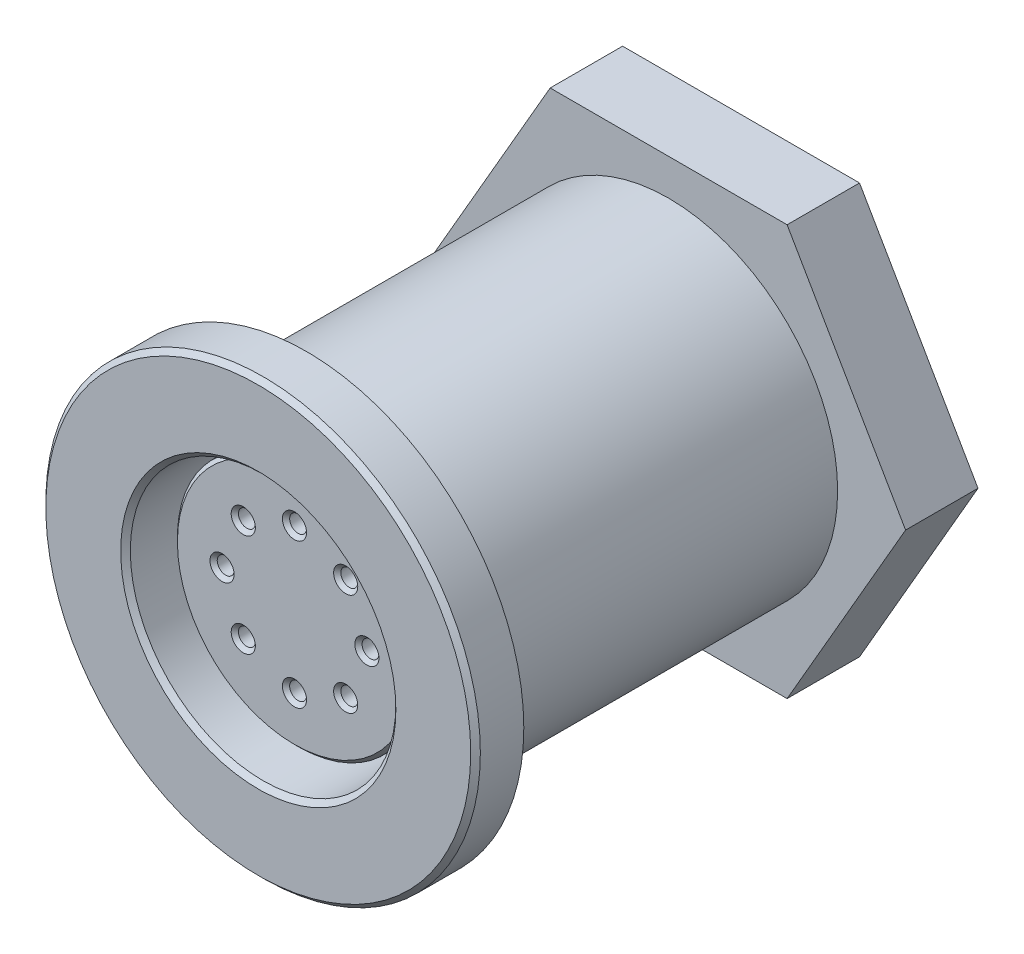
ISO-10303-21;
HEADER;
FILE_DESCRIPTION(('STEP AP214'),'2;1');
FILE_NAME('part.step','',(''),(''),'','','');
FILE_SCHEMA(('AUTOMOTIVE_DESIGN { 1 0 10303 214 1 1 1 1 }'));
ENDSEC;
DATA;
#1=APPLICATION_CONTEXT('core data for automotive mechanical design processes');
#2=APPLICATION_PROTOCOL_DEFINITION('international standard','automotive_design',2000,#1);
#3=PRODUCT_CONTEXT('',#1,'mechanical');
#4=PRODUCT('Part','Part','',(#3));
#5=PRODUCT_RELATED_PRODUCT_CATEGORY('part','',(#4));
#6=PRODUCT_DEFINITION_FORMATION('','',#4);
#7=PRODUCT_DEFINITION_CONTEXT('part definition',#1,'design');
#8=PRODUCT_DEFINITION('design','',#6,#7);
#9=PRODUCT_DEFINITION_SHAPE('','',#8);
#10=(LENGTH_UNIT() NAMED_UNIT(*) SI_UNIT(.MILLI.,.METRE.));
#11=(NAMED_UNIT(*) PLANE_ANGLE_UNIT() SI_UNIT($,.RADIAN.));
#12=(NAMED_UNIT(*) SI_UNIT($,.STERADIAN.) SOLID_ANGLE_UNIT());
#13=UNCERTAINTY_MEASURE_WITH_UNIT(LENGTH_MEASURE(1.E-05),#10,'distance_accuracy_value','');
#14=(GEOMETRIC_REPRESENTATION_CONTEXT(3) GLOBAL_UNCERTAINTY_ASSIGNED_CONTEXT((#13)) GLOBAL_UNIT_ASSIGNED_CONTEXT((#10,
#11,#12)) REPRESENTATION_CONTEXT('',''));
#15=CARTESIAN_POINT('',(0.,0.,0.));
#16=DIRECTION('',(0.,0.,1.));
#17=DIRECTION('',(1.,0.,0.));
#18=AXIS2_PLACEMENT_3D('',#15,#16,#17);
#19=CARTESIAN_POINT('',(0.,0.,-19.));
#20=DIRECTION('',(0.,0.,1.));
#21=DIRECTION('',(1.,0.,0.));
#22=AXIS2_PLACEMENT_3D('',#19,#20,#21);
#23=CYLINDRICAL_SURFACE('',#22,7.);
#24=CARTESIAN_POINT('',(0.,0.,1.));
#25=DIRECTION('',(0.,0.,-1.));
#26=DIRECTION('',(-1.,0.,0.));
#27=AXIS2_PLACEMENT_3D('',#24,#25,#26);
#28=CIRCLE('',#27,7.);
#29=CARTESIAN_POINT('',(-7.,0.,1.));
#30=VERTEX_POINT('',#29);
#31=EDGE_CURVE('E173',#30,#30,#28,.T.);
#32=ORIENTED_EDGE('',*,*,#31,.T.);
#33=EDGE_LOOP('',(#32));
#34=FACE_BOUND('',#33,.T.);
#35=CARTESIAN_POINT('',(0.,0.,-15.));
#36=DIRECTION('',(0.,0.,-1.));
#37=DIRECTION('',(-1.,0.,0.));
#38=AXIS2_PLACEMENT_3D('',#35,#36,#37);
#39=CIRCLE('',#38,7.);
#40=CARTESIAN_POINT('',(-7.,0.,-15.));
#41=VERTEX_POINT('',#40);
#42=EDGE_CURVE('E11',#41,#41,#39,.T.);
#43=ORIENTED_EDGE('',*,*,#42,.F.);
#44=EDGE_LOOP('',(#43));
#45=FACE_BOUND('',#44,.T.);
#46=ADVANCED_FACE('F32',(#34,#45),#23,.T.);
#47=CARTESIAN_POINT('',(0.,0.,-8.));
#48=DIRECTION('',(0.,0.,1.));
#49=DIRECTION('',(1.,0.,0.));
#50=AXIS2_PLACEMENT_3D('',#47,#48,#49);
#51=PLANE('',#50);
#52=CARTESIAN_POINT('',(0.,0.,-8.));
#53=DIRECTION('',(0.,0.,1.));
#54=DIRECTION('',(1.,0.,0.));
#55=AXIS2_PLACEMENT_3D('',#52,#53,#54);
#56=CIRCLE('',#55,5.5);
#57=CARTESIAN_POINT('',(5.5,0.,-8.));
#58=VERTEX_POINT('',#57);
#59=EDGE_CURVE('E182',#58,#58,#56,.T.);
#60=ORIENTED_EDGE('',*,*,#59,.T.);
#61=EDGE_LOOP('',(#60));
#62=FACE_BOUND('',#61,.T.);
#63=CARTESIAN_POINT('',(0.,0.,-8.));
#64=DIRECTION('',(0.,0.,1.));
#65=DIRECTION('',(1.,0.,0.));
#66=AXIS2_PLACEMENT_3D('',#63,#64,#65);
#67=CIRCLE('',#66,5.);
#68=CARTESIAN_POINT('',(5.,0.,-8.));
#69=VERTEX_POINT('',#68);
#70=EDGE_CURVE('E170',#69,#69,#67,.T.);
#71=ORIENTED_EDGE('',*,*,#70,.F.);
#72=EDGE_LOOP('',(#71));
#73=FACE_BOUND('',#72,.T.);
#74=ADVANCED_FACE('F286',(#62,#73),#51,.T.);
#75=CARTESIAN_POINT('',(0.,0.,0.));
#76=DIRECTION('',(0.,0.,1.));
#77=DIRECTION('',(1.,0.,0.));
#78=AXIS2_PLACEMENT_3D('',#75,#76,#77);
#79=PLANE('',#78);
#80=CARTESIAN_POINT('',(0.,0.,0.));
#81=DIRECTION('',(0.,0.,-1.));
#82=DIRECTION('',(-1.,0.,0.));
#83=AXIS2_PLACEMENT_3D('',#80,#81,#82);
#84=CIRCLE('',#83,7.8);
#85=CARTESIAN_POINT('',(-7.8,0.,0.));
#86=VERTEX_POINT('',#85);
#87=EDGE_CURVE('E176',#86,#86,#84,.T.);
#88=ORIENTED_EDGE('',*,*,#87,.F.);
#89=EDGE_LOOP('',(#88));
#90=FACE_BOUND('',#89,.T.);
#91=CARTESIAN_POINT('',(0.,0.,0.));
#92=DIRECTION('',(0.,0.,1.));
#93=DIRECTION('',(1.,0.,0.));
#94=AXIS2_PLACEMENT_3D('',#91,#92,#93);
#95=CIRCLE('',#94,9.);
#96=CARTESIAN_POINT('',(9.,0.,0.));
#97=VERTEX_POINT('',#96);
#98=EDGE_CURVE('E185',#97,#97,#95,.T.);
#99=ORIENTED_EDGE('',*,*,#98,.F.);
#100=EDGE_LOOP('',(#99));
#101=FACE_BOUND('',#100,.T.);
#102=ADVANCED_FACE('F292',(#90,#101),#79,.F.);
#103=CARTESIAN_POINT('',(0.,0.,2.));
#104=DIRECTION('',(0.,0.,-1.));
#105=DIRECTION('',(-1.,0.,0.));
#106=AXIS2_PLACEMENT_3D('',#103,#104,#105);
#107=CYLINDRICAL_SURFACE('',#106,9.);
#108=CARTESIAN_POINT('',(0.,0.,1.80000000000001));
#109=DIRECTION('',(0.,0.,1.));
#110=DIRECTION('',(1.,0.,0.));
#111=AXIS2_PLACEMENT_3D('',#108,#109,#110);
#112=CIRCLE('',#111,9.);
#113=CARTESIAN_POINT('',(9.,0.,1.80000000000001));
#114=VERTEX_POINT('',#113);
#115=EDGE_CURVE('E251',#114,#114,#112,.F.);
#116=ORIENTED_EDGE('',*,*,#115,.T.);
#117=EDGE_LOOP('',(#116));
#118=FACE_BOUND('',#117,.T.);
#119=ORIENTED_EDGE('',*,*,#98,.T.);
#120=EDGE_LOOP('',(#119));
#121=FACE_BOUND('',#120,.T.);
#122=ADVANCED_FACE('F34',(#118,#121),#107,.T.);
#123=CARTESIAN_POINT('',(0.,0.,2.));
#124=DIRECTION('',(0.,0.,1.));
#125=DIRECTION('',(1.,0.,0.));
#126=AXIS2_PLACEMENT_3D('',#123,#124,#125);
#127=PLANE('',#126);
#128=CARTESIAN_POINT('',(0.,0.,2.));
#129=DIRECTION('',(0.,0.,1.));
#130=DIRECTION('',(1.,0.,0.));
#131=AXIS2_PLACEMENT_3D('',#128,#129,#130);
#132=CIRCLE('',#131,5.7);
#133=CARTESIAN_POINT('',(5.7,0.,2.));
#134=VERTEX_POINT('',#133);
#135=EDGE_CURVE('E248',#134,#134,#132,.F.);
#136=ORIENTED_EDGE('',*,*,#135,.T.);
#137=EDGE_LOOP('',(#136));
#138=FACE_BOUND('',#137,.T.);
#139=CARTESIAN_POINT('',(0.,0.,2.));
#140=DIRECTION('',(0.,0.,1.));
#141=DIRECTION('',(1.,0.,0.));
#142=AXIS2_PLACEMENT_3D('',#139,#140,#141);
#143=CIRCLE('',#142,8.80000000000001);
#144=CARTESIAN_POINT('',(8.80000000000001,0.,2.));
#145=VERTEX_POINT('',#144);
#146=EDGE_CURVE('E245',#145,#145,#143,.T.);
#147=ORIENTED_EDGE('',*,*,#146,.T.);
#148=EDGE_LOOP('',(#147));
#149=FACE_BOUND('',#148,.T.);
#150=ADVANCED_FACE('F657',(#138,#149),#127,.T.);
#151=CARTESIAN_POINT('',(0.,0.,-8.));
#152=DIRECTION('',(0.,0.,1.));
#153=DIRECTION('',(1.,0.,0.));
#154=AXIS2_PLACEMENT_3D('',#151,#152,#153);
#155=CYLINDRICAL_SURFACE('',#154,5.5);
#156=CARTESIAN_POINT('',(0.,0.,1.8));
#157=DIRECTION('',(0.,0.,1.));
#158=DIRECTION('',(1.,0.,0.));
#159=AXIS2_PLACEMENT_3D('',#156,#157,#158);
#160=CIRCLE('',#159,5.5);
#161=CARTESIAN_POINT('',(5.5,0.,1.8));
#162=VERTEX_POINT('',#161);
#163=EDGE_CURVE('E242',#162,#162,#160,.T.);
#164=ORIENTED_EDGE('',*,*,#163,.T.);
#165=EDGE_LOOP('',(#164));
#166=FACE_BOUND('',#165,.T.);
#167=ORIENTED_EDGE('',*,*,#59,.F.);
#168=EDGE_LOOP('',(#167));
#169=FACE_BOUND('',#168,.T.);
#170=ADVANCED_FACE('F649',(#166,#169),#155,.F.);
#171=CARTESIAN_POINT('',(0.,0.,1.));
#172=DIRECTION('',(0.,0.,-1.));
#173=DIRECTION('',(-1.,0.,0.));
#174=AXIS2_PLACEMENT_3D('',#171,#172,#173);
#175=CYLINDRICAL_SURFACE('',#174,7.8);
#176=CARTESIAN_POINT('',(0.,0.,1.));
#177=DIRECTION('',(0.,0.,-1.));
#178=DIRECTION('',(-1.,0.,0.));
#179=AXIS2_PLACEMENT_3D('',#176,#177,#178);
#180=CIRCLE('',#179,7.8);
#181=CARTESIAN_POINT('',(-7.8,0.,1.));
#182=VERTEX_POINT('',#181);
#183=EDGE_CURVE('E179',#182,#182,#180,.T.);
#184=ORIENTED_EDGE('',*,*,#183,.F.);
#185=EDGE_LOOP('',(#184));
#186=FACE_BOUND('',#185,.T.);
#187=ORIENTED_EDGE('',*,*,#87,.T.);
#188=EDGE_LOOP('',(#187));
#189=FACE_BOUND('',#188,.T.);
#190=ADVANCED_FACE('F641',(#186,#189),#175,.F.);
#191=CARTESIAN_POINT('',(0.,0.,1.));
#192=DIRECTION('',(0.,0.,-1.));
#193=DIRECTION('',(-1.,0.,0.));
#194=AXIS2_PLACEMENT_3D('',#191,#192,#193);
#195=PLANE('',#194);
#196=ORIENTED_EDGE('',*,*,#31,.F.);
#197=EDGE_LOOP('',(#196));
#198=FACE_BOUND('',#197,.T.);
#199=ORIENTED_EDGE('',*,*,#183,.T.);
#200=EDGE_LOOP('',(#199));
#201=FACE_BOUND('',#200,.T.);
#202=ADVANCED_FACE('F633',(#198,#201),#195,.T.);
#203=CARTESIAN_POINT('',(0.,0.,0.5));
#204=DIRECTION('',(0.,0.,-1.));
#205=DIRECTION('',(-1.,0.,0.));
#206=AXIS2_PLACEMENT_3D('',#203,#204,#205);
#207=CYLINDRICAL_SURFACE('',#206,5.);
#208=CARTESIAN_POINT('',(0.,0.,0.350000000000002));
#209=DIRECTION('',(0.,0.,1.));
#210=DIRECTION('',(1.,0.,0.));
#211=AXIS2_PLACEMENT_3D('',#208,#209,#210);
#212=CIRCLE('',#211,5.);
#213=CARTESIAN_POINT('',(5.,0.,0.350000000000002));
#214=VERTEX_POINT('',#213);
#215=EDGE_CURVE('E233',#214,#214,#212,.F.);
#216=ORIENTED_EDGE('',*,*,#215,.T.);
#217=EDGE_LOOP('',(#216));
#218=FACE_BOUND('',#217,.T.);
#219=ORIENTED_EDGE('',*,*,#70,.T.);
#220=EDGE_LOOP('',(#219));
#221=FACE_BOUND('',#220,.T.);
#222=ADVANCED_FACE('F626',(#218,#221),#207,.T.);
#223=CARTESIAN_POINT('',(0.,0.,0.5));
#224=DIRECTION('',(0.,0.,1.));
#225=DIRECTION('',(1.,0.,0.));
#226=AXIS2_PLACEMENT_3D('',#223,#224,#225);
#227=PLANE('',#226);
#228=CARTESIAN_POINT('',(3.,0.,0.5));
#229=DIRECTION('',(0.,0.,1.));
#230=DIRECTION('',(1.,0.,0.));
#231=AXIS2_PLACEMENT_3D('',#228,#229,#230);
#232=CIRCLE('',#231,0.5);
#233=CARTESIAN_POINT('',(3.5,0.,0.5));
#234=VERTEX_POINT('',#233);
#235=EDGE_CURVE('E215',#234,#234,#232,.F.);
#236=ORIENTED_EDGE('',*,*,#235,.T.);
#237=EDGE_LOOP('',(#236));
#238=FACE_BOUND('',#237,.T.);
#239=CARTESIAN_POINT('',(-3.,0.,0.5));
#240=DIRECTION('',(0.,0.,1.));
#241=DIRECTION('',(1.,0.,0.));
#242=AXIS2_PLACEMENT_3D('',#239,#240,#241);
#243=CIRCLE('',#242,0.500000000000011);
#244=CARTESIAN_POINT('',(-2.49999999999999,0.,0.5));
#245=VERTEX_POINT('',#244);
#246=EDGE_CURVE('E212',#245,#245,#243,.F.);
#247=ORIENTED_EDGE('',*,*,#246,.T.);
#248=EDGE_LOOP('',(#247));
#249=FACE_BOUND('',#248,.T.);
#250=CARTESIAN_POINT('',(2.12132034355965,-2.12132034355963,0.5));
#251=DIRECTION('',(0.,0.,1.));
#252=DIRECTION('',(1.,0.,0.));
#253=AXIS2_PLACEMENT_3D('',#250,#251,#252);
#254=CIRCLE('',#253,0.500000000000011);
#255=CARTESIAN_POINT('',(2.62132034355967,-2.12132034355963,0.5));
#256=VERTEX_POINT('',#255);
#257=EDGE_CURVE('E209',#256,#256,#254,.F.);
#258=ORIENTED_EDGE('',*,*,#257,.T.);
#259=EDGE_LOOP('',(#258));
#260=FACE_BOUND('',#259,.T.);
#261=CARTESIAN_POINT('',(2.12132034355965,2.12132034355963,0.5));
#262=DIRECTION('',(0.,0.,1.));
#263=DIRECTION('',(1.,0.,0.));
#264=AXIS2_PLACEMENT_3D('',#261,#262,#263);
#265=CIRCLE('',#264,0.500000000000011);
#266=CARTESIAN_POINT('',(2.62132034355967,2.12132034355963,0.5));
#267=VERTEX_POINT('',#266);
#268=EDGE_CURVE('E206',#267,#267,#265,.F.);
#269=ORIENTED_EDGE('',*,*,#268,.T.);
#270=EDGE_LOOP('',(#269));
#271=FACE_BOUND('',#270,.T.);
#272=CARTESIAN_POINT('',(-2.12132034355965,-2.12132034355963,0.5));
#273=DIRECTION('',(0.,0.,1.));
#274=DIRECTION('',(1.,0.,0.));
#275=AXIS2_PLACEMENT_3D('',#272,#273,#274);
#276=CIRCLE('',#275,0.500000000000011);
#277=CARTESIAN_POINT('',(-1.62132034355964,-2.12132034355963,0.5));
#278=VERTEX_POINT('',#277);
#279=EDGE_CURVE('E203',#278,#278,#276,.F.);
#280=ORIENTED_EDGE('',*,*,#279,.T.);
#281=EDGE_LOOP('',(#280));
#282=FACE_BOUND('',#281,.T.);
#283=CARTESIAN_POINT('',(-2.12132034355965,2.12132034355963,0.5));
#284=DIRECTION('',(0.,0.,1.));
#285=DIRECTION('',(1.,0.,0.));
#286=AXIS2_PLACEMENT_3D('',#283,#284,#285);
#287=CIRCLE('',#286,0.500000000000011);
#288=CARTESIAN_POINT('',(-1.62132034355964,2.12132034355963,0.5));
#289=VERTEX_POINT('',#288);
#290=EDGE_CURVE('E200',#289,#289,#287,.F.);
#291=ORIENTED_EDGE('',*,*,#290,.T.);
#292=EDGE_LOOP('',(#291));
#293=FACE_BOUND('',#292,.T.);
#294=CARTESIAN_POINT('',(0.,0.,0.5));
#295=DIRECTION('',(0.,0.,1.));
#296=DIRECTION('',(1.,0.,0.));
#297=AXIS2_PLACEMENT_3D('',#294,#295,#296);
#298=CIRCLE('',#297,4.85);
#299=CARTESIAN_POINT('',(4.85,0.,0.5));
#300=VERTEX_POINT('',#299);
#301=EDGE_CURVE('E197',#300,#300,#298,.T.);
#302=ORIENTED_EDGE('',*,*,#301,.T.);
#303=EDGE_LOOP('',(#302));
#304=FACE_BOUND('',#303,.T.);
#305=CARTESIAN_POINT('',(0.,-3.,0.5));
#306=DIRECTION('',(0.,0.,1.));
#307=DIRECTION('',(1.,0.,0.));
#308=AXIS2_PLACEMENT_3D('',#305,#306,#307);
#309=CIRCLE('',#308,0.500000000000011);
#310=CARTESIAN_POINT('',(0.500000000000011,-3.,0.5));
#311=VERTEX_POINT('',#310);
#312=EDGE_CURVE('E194',#311,#311,#309,.F.);
#313=ORIENTED_EDGE('',*,*,#312,.T.);
#314=EDGE_LOOP('',(#313));
#315=FACE_BOUND('',#314,.T.);
#316=CARTESIAN_POINT('',(0.,3.,0.5));
#317=DIRECTION('',(0.,0.,1.));
#318=DIRECTION('',(1.,0.,0.));
#319=AXIS2_PLACEMENT_3D('',#316,#317,#318);
#320=CIRCLE('',#319,0.500000000000011);
#321=CARTESIAN_POINT('',(0.500000000000011,3.,0.5));
#322=VERTEX_POINT('',#321);
#323=EDGE_CURVE('E191',#322,#322,#320,.F.);
#324=ORIENTED_EDGE('',*,*,#323,.T.);
#325=EDGE_LOOP('',(#324));
#326=FACE_BOUND('',#325,.T.);
#327=ADVANCED_FACE('F618',(#238,#249,#260,#271,#282,#293,#304,#315,#326),#227,.T.);
#328=CARTESIAN_POINT('',(0.,3.,-6.5));
#329=DIRECTION('',(0.,0.,1.));
#330=DIRECTION('',(1.,0.,0.));
#331=AXIS2_PLACEMENT_3D('',#328,#329,#330);
#332=CYLINDRICAL_SURFACE('',#331,0.35);
#333=CARTESIAN_POINT('',(0.,3.,0.349999999999992));
#334=DIRECTION('',(0.,0.,1.));
#335=DIRECTION('',(1.,0.,0.));
#336=AXIS2_PLACEMENT_3D('',#333,#334,#335);
#337=CIRCLE('',#336,0.35);
#338=CARTESIAN_POINT('',(0.35,3.,0.349999999999992));
#339=VERTEX_POINT('',#338);
#340=EDGE_CURVE('E239',#339,#339,#337,.T.);
#341=ORIENTED_EDGE('',*,*,#340,.T.);
#342=EDGE_LOOP('',(#341));
#343=FACE_BOUND('',#342,.T.);
#344=CARTESIAN_POINT('',(0.,3.,-6.5));
#345=DIRECTION('',(0.,0.,1.));
#346=DIRECTION('',(1.,0.,0.));
#347=AXIS2_PLACEMENT_3D('',#344,#345,#346);
#348=CIRCLE('',#347,0.35);
#349=CARTESIAN_POINT('',(0.35,3.,-6.5));
#350=VERTEX_POINT('',#349);
#351=EDGE_CURVE('E167',#350,#350,#348,.T.);
#352=ORIENTED_EDGE('',*,*,#351,.F.);
#353=EDGE_LOOP('',(#352));
#354=FACE_BOUND('',#353,.T.);
#355=ADVANCED_FACE('F610',(#343,#354),#332,.F.);
#356=CARTESIAN_POINT('',(0.,3.,-6.5));
#357=DIRECTION('',(0.,0.,1.));
#358=DIRECTION('',(1.,0.,0.));
#359=AXIS2_PLACEMENT_3D('',#356,#357,#358);
#360=PLANE('',#359);
#361=ORIENTED_EDGE('',*,*,#351,.T.);
#362=EDGE_LOOP('',(#361));
#363=FACE_BOUND('',#362,.T.);
#364=ADVANCED_FACE('F602',(#363),#360,.T.);
#365=CARTESIAN_POINT('',(0.,-3.,-6.5));
#366=DIRECTION('',(0.,0.,1.));
#367=DIRECTION('',(1.,0.,0.));
#368=AXIS2_PLACEMENT_3D('',#365,#366,#367);
#369=CYLINDRICAL_SURFACE('',#368,0.35);
#370=CARTESIAN_POINT('',(0.,-3.,0.349999999999992));
#371=DIRECTION('',(0.,0.,1.));
#372=DIRECTION('',(1.,0.,0.));
#373=AXIS2_PLACEMENT_3D('',#370,#371,#372);
#374=CIRCLE('',#373,0.35);
#375=CARTESIAN_POINT('',(0.35,-3.,0.349999999999992));
#376=VERTEX_POINT('',#375);
#377=EDGE_CURVE('E236',#376,#376,#374,.T.);
#378=ORIENTED_EDGE('',*,*,#377,.T.);
#379=EDGE_LOOP('',(#378));
#380=FACE_BOUND('',#379,.T.);
#381=CARTESIAN_POINT('',(0.,-3.,-6.5));
#382=DIRECTION('',(0.,0.,1.));
#383=DIRECTION('',(1.,0.,0.));
#384=AXIS2_PLACEMENT_3D('',#381,#382,#383);
#385=CIRCLE('',#384,0.35);
#386=CARTESIAN_POINT('',(0.35,-3.,-6.5));
#387=VERTEX_POINT('',#386);
#388=EDGE_CURVE('E164',#387,#387,#385,.T.);
#389=ORIENTED_EDGE('',*,*,#388,.F.);
#390=EDGE_LOOP('',(#389));
#391=FACE_BOUND('',#390,.T.);
#392=ADVANCED_FACE('F594',(#380,#391),#369,.F.);
#393=CARTESIAN_POINT('',(0.,-3.,-6.5));
#394=DIRECTION('',(0.,0.,1.));
#395=DIRECTION('',(1.,0.,0.));
#396=AXIS2_PLACEMENT_3D('',#393,#394,#395);
#397=PLANE('',#396);
#398=ORIENTED_EDGE('',*,*,#388,.T.);
#399=EDGE_LOOP('',(#398));
#400=FACE_BOUND('',#399,.T.);
#401=ADVANCED_FACE('F586',(#400),#397,.T.);
#402=CARTESIAN_POINT('',(2.12132034355965,2.12132034355963,-6.5));
#403=DIRECTION('',(0.,0.,1.));
#404=DIRECTION('',(1.,0.,0.));
#405=AXIS2_PLACEMENT_3D('',#402,#403,#404);
#406=CYLINDRICAL_SURFACE('',#405,0.35);
#407=CARTESIAN_POINT('',(2.12132034355965,2.12132034355963,0.349999999999992));
#408=DIRECTION('',(0.,0.,1.));
#409=DIRECTION('',(1.,0.,0.));
#410=AXIS2_PLACEMENT_3D('',#407,#408,#409);
#411=CIRCLE('',#410,0.35);
#412=CARTESIAN_POINT('',(2.47132034355965,2.12132034355963,0.349999999999992));
#413=VERTEX_POINT('',#412);
#414=EDGE_CURVE('E224',#413,#413,#411,.T.);
#415=ORIENTED_EDGE('',*,*,#414,.T.);
#416=EDGE_LOOP('',(#415));
#417=FACE_BOUND('',#416,.T.);
#418=CARTESIAN_POINT('',(2.12132034355965,2.12132034355963,-6.5));
#419=DIRECTION('',(0.,0.,1.));
#420=DIRECTION('',(1.,0.,0.));
#421=AXIS2_PLACEMENT_3D('',#418,#419,#420);
#422=CIRCLE('',#421,0.35);
#423=CARTESIAN_POINT('',(2.47132034355965,2.12132034355963,-6.5));
#424=VERTEX_POINT('',#423);
#425=EDGE_CURVE('E161',#424,#424,#422,.T.);
#426=ORIENTED_EDGE('',*,*,#425,.F.);
#427=EDGE_LOOP('',(#426));
#428=FACE_BOUND('',#427,.T.);
#429=ADVANCED_FACE('F578',(#417,#428),#406,.F.);
#430=CARTESIAN_POINT('',(2.12132034355965,2.12132034355963,-6.5));
#431=DIRECTION('',(0.,0.,1.));
#432=DIRECTION('',(1.,0.,0.));
#433=AXIS2_PLACEMENT_3D('',#430,#431,#432);
#434=PLANE('',#433);
#435=ORIENTED_EDGE('',*,*,#425,.T.);
#436=EDGE_LOOP('',(#435));
#437=FACE_BOUND('',#436,.T.);
#438=ADVANCED_FACE('F570',(#437),#434,.T.);
#439=CARTESIAN_POINT('',(2.12132034355965,-2.12132034355963,-6.5));
#440=DIRECTION('',(0.,0.,1.));
#441=DIRECTION('',(1.,0.,0.));
#442=AXIS2_PLACEMENT_3D('',#439,#440,#441);
#443=CYLINDRICAL_SURFACE('',#442,0.350000000000001);
#444=CARTESIAN_POINT('',(2.12132034355965,-2.12132034355963,0.349999999999993));
#445=DIRECTION('',(0.,0.,1.));
#446=DIRECTION('',(1.,0.,0.));
#447=AXIS2_PLACEMENT_3D('',#444,#445,#446);
#448=CIRCLE('',#447,0.350000000000001);
#449=CARTESIAN_POINT('',(2.47132034355966,-2.12132034355963,0.349999999999993));
#450=VERTEX_POINT('',#449);
#451=EDGE_CURVE('E221',#450,#450,#448,.T.);
#452=ORIENTED_EDGE('',*,*,#451,.T.);
#453=EDGE_LOOP('',(#452));
#454=FACE_BOUND('',#453,.T.);
#455=CARTESIAN_POINT('',(2.12132034355965,-2.12132034355963,-6.5));
#456=DIRECTION('',(0.,0.,1.));
#457=DIRECTION('',(1.,0.,0.));
#458=AXIS2_PLACEMENT_3D('',#455,#456,#457);
#459=CIRCLE('',#458,0.350000000000001);
#460=CARTESIAN_POINT('',(2.47132034355966,-2.12132034355963,-6.5));
#461=VERTEX_POINT('',#460);
#462=EDGE_CURVE('E158',#461,#461,#459,.T.);
#463=ORIENTED_EDGE('',*,*,#462,.F.);
#464=EDGE_LOOP('',(#463));
#465=FACE_BOUND('',#464,.T.);
#466=ADVANCED_FACE('F562',(#454,#465),#443,.F.);
#467=CARTESIAN_POINT('',(2.12132034355965,-2.12132034355963,-6.5));
#468=DIRECTION('',(0.,0.,1.));
#469=DIRECTION('',(1.,0.,0.));
#470=AXIS2_PLACEMENT_3D('',#467,#468,#469);
#471=PLANE('',#470);
#472=ORIENTED_EDGE('',*,*,#462,.T.);
#473=EDGE_LOOP('',(#472));
#474=FACE_BOUND('',#473,.T.);
#475=ADVANCED_FACE('F554',(#474),#471,.T.);
#476=CARTESIAN_POINT('',(-2.12132034355965,2.12132034355963,-6.5));
#477=DIRECTION('',(0.,0.,1.));
#478=DIRECTION('',(1.,0.,0.));
#479=AXIS2_PLACEMENT_3D('',#476,#477,#478);
#480=CYLINDRICAL_SURFACE('',#479,0.35);
#481=CARTESIAN_POINT('',(-2.12132034355965,2.12132034355963,0.349999999999992));
#482=DIRECTION('',(0.,0.,1.));
#483=DIRECTION('',(1.,0.,0.));
#484=AXIS2_PLACEMENT_3D('',#481,#482,#483);
#485=CIRCLE('',#484,0.35);
#486=CARTESIAN_POINT('',(-1.77132034355965,2.12132034355963,0.349999999999992));
#487=VERTEX_POINT('',#486);
#488=EDGE_CURVE('E230',#487,#487,#485,.T.);
#489=ORIENTED_EDGE('',*,*,#488,.T.);
#490=EDGE_LOOP('',(#489));
#491=FACE_BOUND('',#490,.T.);
#492=CARTESIAN_POINT('',(-2.12132034355965,2.12132034355963,-6.5));
#493=DIRECTION('',(0.,0.,1.));
#494=DIRECTION('',(1.,0.,0.));
#495=AXIS2_PLACEMENT_3D('',#492,#493,#494);
#496=CIRCLE('',#495,0.35);
#497=CARTESIAN_POINT('',(-1.77132034355965,2.12132034355963,-6.5));
#498=VERTEX_POINT('',#497);
#499=EDGE_CURVE('E155',#498,#498,#496,.T.);
#500=ORIENTED_EDGE('',*,*,#499,.F.);
#501=EDGE_LOOP('',(#500));
#502=FACE_BOUND('',#501,.T.);
#503=ADVANCED_FACE('F546',(#491,#502),#480,.F.);
#504=CARTESIAN_POINT('',(-2.12132034355965,2.12132034355963,-6.5));
#505=DIRECTION('',(0.,0.,1.));
#506=DIRECTION('',(1.,0.,0.));
#507=AXIS2_PLACEMENT_3D('',#504,#505,#506);
#508=PLANE('',#507);
#509=ORIENTED_EDGE('',*,*,#499,.T.);
#510=EDGE_LOOP('',(#509));
#511=FACE_BOUND('',#510,.T.);
#512=ADVANCED_FACE('F538',(#511),#508,.T.);
#513=CARTESIAN_POINT('',(-2.12132034355965,-2.12132034355963,-6.5));
#514=DIRECTION('',(0.,0.,1.));
#515=DIRECTION('',(1.,0.,0.));
#516=AXIS2_PLACEMENT_3D('',#513,#514,#515);
#517=CYLINDRICAL_SURFACE('',#516,0.35);
#518=CARTESIAN_POINT('',(-2.12132034355965,-2.12132034355963,0.349999999999992));
#519=DIRECTION('',(0.,0.,1.));
#520=DIRECTION('',(1.,0.,0.));
#521=AXIS2_PLACEMENT_3D('',#518,#519,#520);
#522=CIRCLE('',#521,0.35);
#523=CARTESIAN_POINT('',(-1.77132034355965,-2.12132034355963,0.349999999999992));
#524=VERTEX_POINT('',#523);
#525=EDGE_CURVE('E227',#524,#524,#522,.T.);
#526=ORIENTED_EDGE('',*,*,#525,.T.);
#527=EDGE_LOOP('',(#526));
#528=FACE_BOUND('',#527,.T.);
#529=CARTESIAN_POINT('',(-2.12132034355965,-2.12132034355963,-6.5));
#530=DIRECTION('',(0.,0.,1.));
#531=DIRECTION('',(1.,0.,0.));
#532=AXIS2_PLACEMENT_3D('',#529,#530,#531);
#533=CIRCLE('',#532,0.35);
#534=CARTESIAN_POINT('',(-1.77132034355965,-2.12132034355963,-6.5));
#535=VERTEX_POINT('',#534);
#536=EDGE_CURVE('E152',#535,#535,#533,.T.);
#537=ORIENTED_EDGE('',*,*,#536,.F.);
#538=EDGE_LOOP('',(#537));
#539=FACE_BOUND('',#538,.T.);
#540=ADVANCED_FACE('F530',(#528,#539),#517,.F.);
#541=CARTESIAN_POINT('',(-2.12132034355965,-2.12132034355963,-6.5));
#542=DIRECTION('',(0.,0.,1.));
#543=DIRECTION('',(1.,0.,0.));
#544=AXIS2_PLACEMENT_3D('',#541,#542,#543);
#545=PLANE('',#544);
#546=ORIENTED_EDGE('',*,*,#536,.T.);
#547=EDGE_LOOP('',(#546));
#548=FACE_BOUND('',#547,.T.);
#549=ADVANCED_FACE('F522',(#548),#545,.T.);
#550=CARTESIAN_POINT('',(-3.,0.,-6.5));
#551=DIRECTION('',(0.,0.,1.));
#552=DIRECTION('',(1.,0.,0.));
#553=AXIS2_PLACEMENT_3D('',#550,#551,#552);
#554=CYLINDRICAL_SURFACE('',#553,0.35);
#555=CARTESIAN_POINT('',(-3.,0.,0.349999999999992));
#556=DIRECTION('',(0.,0.,1.));
#557=DIRECTION('',(1.,0.,0.));
#558=AXIS2_PLACEMENT_3D('',#555,#556,#557);
#559=CIRCLE('',#558,0.35);
#560=CARTESIAN_POINT('',(-2.65,0.,0.349999999999992));
#561=VERTEX_POINT('',#560);
#562=EDGE_CURVE('E218',#561,#561,#559,.T.);
#563=ORIENTED_EDGE('',*,*,#562,.T.);
#564=EDGE_LOOP('',(#563));
#565=FACE_BOUND('',#564,.T.);
#566=CARTESIAN_POINT('',(-3.,0.,-6.5));
#567=DIRECTION('',(0.,0.,1.));
#568=DIRECTION('',(1.,0.,0.));
#569=AXIS2_PLACEMENT_3D('',#566,#567,#568);
#570=CIRCLE('',#569,0.35);
#571=CARTESIAN_POINT('',(-2.65,0.,-6.5));
#572=VERTEX_POINT('',#571);
#573=EDGE_CURVE('E149',#572,#572,#570,.T.);
#574=ORIENTED_EDGE('',*,*,#573,.F.);
#575=EDGE_LOOP('',(#574));
#576=FACE_BOUND('',#575,.T.);
#577=ADVANCED_FACE('F514',(#565,#576),#554,.F.);
#578=CARTESIAN_POINT('',(-3.,0.,-6.5));
#579=DIRECTION('',(0.,0.,1.));
#580=DIRECTION('',(1.,0.,0.));
#581=AXIS2_PLACEMENT_3D('',#578,#579,#580);
#582=PLANE('',#581);
#583=ORIENTED_EDGE('',*,*,#573,.T.);
#584=EDGE_LOOP('',(#583));
#585=FACE_BOUND('',#584,.T.);
#586=ADVANCED_FACE('F506',(#585),#582,.T.);
#587=CARTESIAN_POINT('',(3.,0.,-6.5));
#588=DIRECTION('',(0.,0.,1.));
#589=DIRECTION('',(1.,0.,0.));
#590=AXIS2_PLACEMENT_3D('',#587,#588,#589);
#591=CYLINDRICAL_SURFACE('',#590,0.35);
#592=CARTESIAN_POINT('',(3.,0.,0.350000000000002));
#593=DIRECTION('',(0.,0.,1.));
#594=DIRECTION('',(1.,0.,0.));
#595=AXIS2_PLACEMENT_3D('',#592,#593,#594);
#596=CIRCLE('',#595,0.35);
#597=CARTESIAN_POINT('',(3.35,0.,0.350000000000002));
#598=VERTEX_POINT('',#597);
#599=EDGE_CURVE('E188',#598,#598,#596,.T.);
#600=ORIENTED_EDGE('',*,*,#599,.T.);
#601=EDGE_LOOP('',(#600));
#602=FACE_BOUND('',#601,.T.);
#603=CARTESIAN_POINT('',(3.,0.,-6.5));
#604=DIRECTION('',(0.,0.,1.));
#605=DIRECTION('',(1.,0.,0.));
#606=AXIS2_PLACEMENT_3D('',#603,#604,#605);
#607=CIRCLE('',#606,0.35);
#608=CARTESIAN_POINT('',(3.35,0.,-6.5));
#609=VERTEX_POINT('',#608);
#610=EDGE_CURVE('E146',#609,#609,#607,.T.);
#611=ORIENTED_EDGE('',*,*,#610,.F.);
#612=EDGE_LOOP('',(#611));
#613=FACE_BOUND('',#612,.T.);
#614=ADVANCED_FACE('F497',(#602,#613),#591,.F.);
#615=CARTESIAN_POINT('',(3.,0.,-6.5));
#616=DIRECTION('',(0.,0.,1.));
#617=DIRECTION('',(1.,0.,0.));
#618=AXIS2_PLACEMENT_3D('',#615,#616,#617);
#619=PLANE('',#618);
#620=ORIENTED_EDGE('',*,*,#610,.T.);
#621=EDGE_LOOP('',(#620));
#622=FACE_BOUND('',#621,.T.);
#623=ADVANCED_FACE('F488',(#622),#619,.T.);
#624=CARTESIAN_POINT('',(3.,0.,0.350000000000002));
#625=DIRECTION('',(0.,0.,1.));
#626=DIRECTION('',(1.,0.,0.));
#627=AXIS2_PLACEMENT_3D('',#624,#625,#626);
#628=CONICAL_SURFACE('',#627,0.35,0.785398163397456);
#629=ORIENTED_EDGE('',*,*,#235,.F.);
#630=EDGE_LOOP('',(#629));
#631=FACE_BOUND('',#630,.T.);
#632=ORIENTED_EDGE('',*,*,#599,.F.);
#633=EDGE_LOOP('',(#632));
#634=FACE_BOUND('',#633,.T.);
#635=ADVANCED_FACE('F480',(#631,#634),#628,.F.);
#636=CARTESIAN_POINT('',(-3.,0.,0.349999999999992));
#637=DIRECTION('',(0.,0.,1.));
#638=DIRECTION('',(1.,0.,0.));
#639=AXIS2_PLACEMENT_3D('',#636,#637,#638);
#640=CONICAL_SURFACE('',#639,0.35,0.785398163397456);
#641=ORIENTED_EDGE('',*,*,#246,.F.);
#642=EDGE_LOOP('',(#641));
#643=FACE_BOUND('',#642,.T.);
#644=ORIENTED_EDGE('',*,*,#562,.F.);
#645=EDGE_LOOP('',(#644));
#646=FACE_BOUND('',#645,.T.);
#647=ADVANCED_FACE('F472',(#643,#646),#640,.F.);
#648=CARTESIAN_POINT('',(2.12132034355965,-2.12132034355963,0.349999999999993));
#649=DIRECTION('',(0.,0.,1.));
#650=DIRECTION('',(1.,0.,0.));
#651=AXIS2_PLACEMENT_3D('',#648,#649,#650);
#652=CONICAL_SURFACE('',#651,0.350000000000001,0.785398163397456);
#653=ORIENTED_EDGE('',*,*,#257,.F.);
#654=EDGE_LOOP('',(#653));
#655=FACE_BOUND('',#654,.T.);
#656=ORIENTED_EDGE('',*,*,#451,.F.);
#657=EDGE_LOOP('',(#656));
#658=FACE_BOUND('',#657,.T.);
#659=ADVANCED_FACE('F464',(#655,#658),#652,.F.);
#660=CARTESIAN_POINT('',(2.12132034355965,2.12132034355963,0.349999999999992));
#661=DIRECTION('',(0.,0.,1.));
#662=DIRECTION('',(1.,0.,0.));
#663=AXIS2_PLACEMENT_3D('',#660,#661,#662);
#664=CONICAL_SURFACE('',#663,0.35,0.785398163397455);
#665=ORIENTED_EDGE('',*,*,#268,.F.);
#666=EDGE_LOOP('',(#665));
#667=FACE_BOUND('',#666,.T.);
#668=ORIENTED_EDGE('',*,*,#414,.F.);
#669=EDGE_LOOP('',(#668));
#670=FACE_BOUND('',#669,.T.);
#671=ADVANCED_FACE('F456',(#667,#670),#664,.F.);
#672=CARTESIAN_POINT('',(-2.12132034355965,-2.12132034355963,0.349999999999992));
#673=DIRECTION('',(0.,0.,1.));
#674=DIRECTION('',(1.,0.,0.));
#675=AXIS2_PLACEMENT_3D('',#672,#673,#674);
#676=CONICAL_SURFACE('',#675,0.35,0.785398163397458);
#677=ORIENTED_EDGE('',*,*,#279,.F.);
#678=EDGE_LOOP('',(#677));
#679=FACE_BOUND('',#678,.T.);
#680=ORIENTED_EDGE('',*,*,#525,.F.);
#681=EDGE_LOOP('',(#680));
#682=FACE_BOUND('',#681,.T.);
#683=ADVANCED_FACE('F448',(#679,#682),#676,.F.);
#684=CARTESIAN_POINT('',(-2.12132034355965,2.12132034355963,0.349999999999992));
#685=DIRECTION('',(0.,0.,1.));
#686=DIRECTION('',(1.,0.,0.));
#687=AXIS2_PLACEMENT_3D('',#684,#685,#686);
#688=CONICAL_SURFACE('',#687,0.35,0.785398163397458);
#689=ORIENTED_EDGE('',*,*,#290,.F.);
#690=EDGE_LOOP('',(#689));
#691=FACE_BOUND('',#690,.T.);
#692=ORIENTED_EDGE('',*,*,#488,.F.);
#693=EDGE_LOOP('',(#692));
#694=FACE_BOUND('',#693,.T.);
#695=ADVANCED_FACE('F440',(#691,#694),#688,.F.);
#696=CARTESIAN_POINT('',(0.,0.,0.5));
#697=DIRECTION('',(0.,0.,-1.));
#698=DIRECTION('',(-1.,0.,0.));
#699=AXIS2_PLACEMENT_3D('',#696,#697,#698);
#700=CONICAL_SURFACE('',#699,4.85,0.785398163397454);
#701=ORIENTED_EDGE('',*,*,#215,.F.);
#702=EDGE_LOOP('',(#701));
#703=FACE_BOUND('',#702,.T.);
#704=ORIENTED_EDGE('',*,*,#301,.F.);
#705=EDGE_LOOP('',(#704));
#706=FACE_BOUND('',#705,.T.);
#707=ADVANCED_FACE('F432',(#703,#706),#700,.T.);
#708=CARTESIAN_POINT('',(0.,-3.,0.349999999999992));
#709=DIRECTION('',(0.,0.,1.));
#710=DIRECTION('',(1.,0.,0.));
#711=AXIS2_PLACEMENT_3D('',#708,#709,#710);
#712=CONICAL_SURFACE('',#711,0.35,0.785398163397456);
#713=ORIENTED_EDGE('',*,*,#312,.F.);
#714=EDGE_LOOP('',(#713));
#715=FACE_BOUND('',#714,.T.);
#716=ORIENTED_EDGE('',*,*,#377,.F.);
#717=EDGE_LOOP('',(#716));
#718=FACE_BOUND('',#717,.T.);
#719=ADVANCED_FACE('F423',(#715,#718),#712,.F.);
#720=CARTESIAN_POINT('',(0.,3.,0.349999999999992));
#721=DIRECTION('',(0.,0.,1.));
#722=DIRECTION('',(1.,0.,0.));
#723=AXIS2_PLACEMENT_3D('',#720,#721,#722);
#724=CONICAL_SURFACE('',#723,0.35,0.785398163397456);
#725=ORIENTED_EDGE('',*,*,#323,.F.);
#726=EDGE_LOOP('',(#725));
#727=FACE_BOUND('',#726,.T.);
#728=ORIENTED_EDGE('',*,*,#340,.F.);
#729=EDGE_LOOP('',(#728));
#730=FACE_BOUND('',#729,.T.);
#731=ADVANCED_FACE('F414',(#727,#730),#724,.F.);
#732=CARTESIAN_POINT('',(0.,0.,1.8));
#733=DIRECTION('',(0.,0.,1.));
#734=DIRECTION('',(1.,0.,0.));
#735=AXIS2_PLACEMENT_3D('',#732,#733,#734);
#736=CONICAL_SURFACE('',#735,5.5,0.785398163397448);
#737=ORIENTED_EDGE('',*,*,#135,.F.);
#738=EDGE_LOOP('',(#737));
#739=FACE_BOUND('',#738,.T.);
#740=ORIENTED_EDGE('',*,*,#163,.F.);
#741=EDGE_LOOP('',(#740));
#742=FACE_BOUND('',#741,.T.);
#743=ADVANCED_FACE('F407',(#739,#742),#736,.F.);
#744=CARTESIAN_POINT('',(0.,0.,2.));
#745=DIRECTION('',(0.,0.,-1.));
#746=DIRECTION('',(-1.,0.,0.));
#747=AXIS2_PLACEMENT_3D('',#744,#745,#746);
#748=CONICAL_SURFACE('',#747,8.80000000000001,0.785398163397453);
#749=ORIENTED_EDGE('',*,*,#115,.F.);
#750=EDGE_LOOP('',(#749));
#751=FACE_BOUND('',#750,.T.);
#752=ORIENTED_EDGE('',*,*,#146,.F.);
#753=EDGE_LOOP('',(#752));
#754=FACE_BOUND('',#753,.T.);
#755=ADVANCED_FACE('F311',(#751,#754),#748,.T.);
#756=CARTESIAN_POINT('',(9.81495457622364,0.,-15.));
#757=DIRECTION('',(0.,0.,-1.));
#758=DIRECTION('',(-1.,0.,0.));
#759=AXIS2_PLACEMENT_3D('',#756,#757,#758);
#760=PLANE('',#759);
#761=DIRECTION('',(0.5,-0.866025403784438,0.));
#762=VECTOR('',#761,1.);
#763=CARTESIAN_POINT('',(9.81495457622364,0.,-15.));
#764=LINE('',#763,#762);
#765=CARTESIAN_POINT('',(4.90747728811182,8.5,-15.));
#766=VERTEX_POINT('',#765);
#767=CARTESIAN_POINT('',(9.81495457622364,0.,-15.));
#768=VERTEX_POINT('',#767);
#769=EDGE_CURVE('E90',#766,#768,#764,.T.);
#770=ORIENTED_EDGE('',*,*,#769,.F.);
#771=DIRECTION('',(1.,0.,0.));
#772=VECTOR('',#771,1.);
#773=CARTESIAN_POINT('',(4.90747728811182,8.5,-15.));
#774=LINE('',#773,#772);
#775=CARTESIAN_POINT('',(-4.90747728811182,8.5,-15.));
#776=VERTEX_POINT('',#775);
#777=EDGE_CURVE('E95',#776,#766,#774,.T.);
#778=ORIENTED_EDGE('',*,*,#777,.F.);
#779=DIRECTION('',(0.5,0.866025403784439,0.));
#780=VECTOR('',#779,1.);
#781=CARTESIAN_POINT('',(-4.90747728811182,8.5,-15.));
#782=LINE('',#781,#780);
#783=CARTESIAN_POINT('',(-9.81495457622364,0.,-15.));
#784=VERTEX_POINT('',#783);
#785=EDGE_CURVE('E127',#784,#776,#782,.T.);
#786=ORIENTED_EDGE('',*,*,#785,.F.);
#787=DIRECTION('',(-0.5,0.866025403784439,0.));
#788=VECTOR('',#787,1.);
#789=CARTESIAN_POINT('',(-9.81495457622364,0.,-15.));
#790=LINE('',#789,#788);
#791=CARTESIAN_POINT('',(-4.90747728811182,-8.5,-15.));
#792=VERTEX_POINT('',#791);
#793=EDGE_CURVE('E124',#792,#784,#790,.T.);
#794=ORIENTED_EDGE('',*,*,#793,.F.);
#795=DIRECTION('',(-1.,0.,0.));
#796=VECTOR('',#795,1.);
#797=CARTESIAN_POINT('',(-4.90747728811182,-8.5,-15.));
#798=LINE('',#797,#796);
#799=CARTESIAN_POINT('',(4.90747728811181,-8.5,-15.));
#800=VERTEX_POINT('',#799);
#801=EDGE_CURVE('E121',#800,#792,#798,.T.);
#802=ORIENTED_EDGE('',*,*,#801,.F.);
#803=DIRECTION('',(-0.500000000000001,-0.866025403784438,0.));
#804=VECTOR('',#803,1.);
#805=CARTESIAN_POINT('',(4.90747728811181,-8.5,-15.));
#806=LINE('',#805,#804);
#807=EDGE_CURVE('E119',#768,#800,#806,.T.);
#808=ORIENTED_EDGE('',*,*,#807,.F.);
#809=EDGE_LOOP('',(#770,#778,#786,#794,#802,#808));
#810=FACE_BOUND('',#809,.T.);
#811=ORIENTED_EDGE('',*,*,#42,.T.);
#812=EDGE_LOOP('',(#811));
#813=FACE_BOUND('',#812,.T.);
#814=ADVANCED_FACE('F303',(#810,#813),#760,.F.);
#815=CARTESIAN_POINT('',(9.81495457622364,0.,-18.));
#816=DIRECTION('',(0.,0.,-1.));
#817=DIRECTION('',(-1.,0.,0.));
#818=AXIS2_PLACEMENT_3D('',#815,#816,#817);
#819=PLANE('',#818);
#820=DIRECTION('',(0.5,-0.866025403784438,0.));
#821=VECTOR('',#820,1.);
#822=CARTESIAN_POINT('',(9.81495457622364,0.,-18.));
#823=LINE('',#822,#821);
#824=CARTESIAN_POINT('',(4.90747728811182,8.5,-18.));
#825=VERTEX_POINT('',#824);
#826=CARTESIAN_POINT('',(9.81495457622364,0.,-18.));
#827=VERTEX_POINT('',#826);
#828=EDGE_CURVE('E88',#825,#827,#823,.T.);
#829=ORIENTED_EDGE('',*,*,#828,.T.);
#830=DIRECTION('',(-0.500000000000001,-0.866025403784438,0.));
#831=VECTOR('',#830,1.);
#832=CARTESIAN_POINT('',(4.90747728811181,-8.5,-18.));
#833=LINE('',#832,#831);
#834=CARTESIAN_POINT('',(4.90747728811181,-8.5,-18.));
#835=VERTEX_POINT('',#834);
#836=EDGE_CURVE('E98',#827,#835,#833,.T.);
#837=ORIENTED_EDGE('',*,*,#836,.T.);
#838=DIRECTION('',(-1.,0.,0.));
#839=VECTOR('',#838,1.);
#840=CARTESIAN_POINT('',(-4.90747728811182,-8.5,-18.));
#841=LINE('',#840,#839);
#842=CARTESIAN_POINT('',(-4.90747728811182,-8.5,-18.));
#843=VERTEX_POINT('',#842);
#844=EDGE_CURVE('E103',#835,#843,#841,.T.);
#845=ORIENTED_EDGE('',*,*,#844,.T.);
#846=DIRECTION('',(-0.5,0.866025403784439,0.));
#847=VECTOR('',#846,1.);
#848=CARTESIAN_POINT('',(-9.81495457622364,0.,-18.));
#849=LINE('',#848,#847);
#850=CARTESIAN_POINT('',(-9.81495457622364,0.,-18.));
#851=VERTEX_POINT('',#850);
#852=EDGE_CURVE('E112',#843,#851,#849,.T.);
#853=ORIENTED_EDGE('',*,*,#852,.T.);
#854=DIRECTION('',(0.5,0.866025403784439,0.));
#855=VECTOR('',#854,1.);
#856=CARTESIAN_POINT('',(-4.90747728811182,8.5,-18.));
#857=LINE('',#856,#855);
#858=CARTESIAN_POINT('',(-4.90747728811182,8.5,-18.));
#859=VERTEX_POINT('',#858);
#860=EDGE_CURVE('E115',#851,#859,#857,.T.);
#861=ORIENTED_EDGE('',*,*,#860,.T.);
#862=DIRECTION('',(1.,0.,0.));
#863=VECTOR('',#862,1.);
#864=CARTESIAN_POINT('',(4.90747728811182,8.5,-18.));
#865=LINE('',#864,#863);
#866=EDGE_CURVE('E108',#859,#825,#865,.T.);
#867=ORIENTED_EDGE('',*,*,#866,.T.);
#868=EDGE_LOOP('',(#829,#837,#845,#853,#861,#867));
#869=FACE_BOUND('',#868,.T.);
#870=CARTESIAN_POINT('',(0.,0.,-18.));
#871=DIRECTION('',(0.,0.,-1.));
#872=DIRECTION('',(-1.,0.,0.));
#873=AXIS2_PLACEMENT_3D('',#870,#871,#872);
#874=CIRCLE('',#873,7.);
#875=CARTESIAN_POINT('',(-7.,0.,-18.));
#876=VERTEX_POINT('',#875);
#877=EDGE_CURVE('E131',#876,#876,#874,.T.);
#878=ORIENTED_EDGE('',*,*,#877,.F.);
#879=EDGE_LOOP('',(#878));
#880=FACE_BOUND('',#879,.T.);
#881=ADVANCED_FACE('F105',(#869,#880),#819,.T.);
#882=CARTESIAN_POINT('',(9.81495457622364,0.,-15.));
#883=DIRECTION('',(0.866025403784438,0.5,0.));
#884=DIRECTION('',(-0.5,0.866025403784439,0.));
#885=AXIS2_PLACEMENT_3D('',#882,#883,#884);
#886=PLANE('',#885);
#887=ORIENTED_EDGE('',*,*,#828,.F.);
#888=DIRECTION('',(0.,0.,-1.));
#889=VECTOR('',#888,1.);
#890=CARTESIAN_POINT('',(4.90747728811182,8.5,-15.));
#891=LINE('',#890,#889);
#892=EDGE_CURVE('E47',#766,#825,#891,.T.);
#893=ORIENTED_EDGE('',*,*,#892,.F.);
#894=ORIENTED_EDGE('',*,*,#769,.T.);
#895=DIRECTION('',(0.,0.,-1.));
#896=VECTOR('',#895,1.);
#897=CARTESIAN_POINT('',(9.81495457622364,0.,-15.));
#898=LINE('',#897,#896);
#899=EDGE_CURVE('E84',#768,#827,#898,.T.);
#900=ORIENTED_EDGE('',*,*,#899,.T.);
#901=EDGE_LOOP('',(#887,#893,#894,#900));
#902=FACE_BOUND('',#901,.T.);
#903=ADVANCED_FACE('F86',(#902),#886,.T.);
#904=CARTESIAN_POINT('',(4.90747728811182,8.5,-15.));
#905=DIRECTION('',(0.,1.,0.));
#906=DIRECTION('',(-1.,0.,0.));
#907=AXIS2_PLACEMENT_3D('',#904,#905,#906);
#908=PLANE('',#907);
#909=ORIENTED_EDGE('',*,*,#866,.F.);
#910=DIRECTION('',(0.,0.,-1.));
#911=VECTOR('',#910,1.);
#912=CARTESIAN_POINT('',(-4.90747728811182,8.5,-15.));
#913=LINE('',#912,#911);
#914=EDGE_CURVE('E55',#776,#859,#913,.T.);
#915=ORIENTED_EDGE('',*,*,#914,.F.);
#916=ORIENTED_EDGE('',*,*,#777,.T.);
#917=ORIENTED_EDGE('',*,*,#892,.T.);
#918=EDGE_LOOP('',(#909,#915,#916,#917));
#919=FACE_BOUND('',#918,.T.);
#920=ADVANCED_FACE('F309',(#919),#908,.T.);
#921=CARTESIAN_POINT('',(-4.90747728811182,8.5,-15.));
#922=DIRECTION('',(-0.866025403784438,0.5,0.));
#923=DIRECTION('',(-0.5,-0.866025403784439,0.));
#924=AXIS2_PLACEMENT_3D('',#921,#922,#923);
#925=PLANE('',#924);
#926=ORIENTED_EDGE('',*,*,#860,.F.);
#927=DIRECTION('',(0.,0.,-1.));
#928=VECTOR('',#927,1.);
#929=CARTESIAN_POINT('',(-9.81495457622364,0.,-15.));
#930=LINE('',#929,#928);
#931=EDGE_CURVE('E133',#784,#851,#930,.T.);
#932=ORIENTED_EDGE('',*,*,#931,.F.);
#933=ORIENTED_EDGE('',*,*,#785,.T.);
#934=ORIENTED_EDGE('',*,*,#914,.T.);
#935=EDGE_LOOP('',(#926,#932,#933,#934));
#936=FACE_BOUND('',#935,.T.);
#937=ADVANCED_FACE('F317',(#936),#925,.T.);
#938=CARTESIAN_POINT('',(-9.81495457622364,0.,-15.));
#939=DIRECTION('',(-0.866025403784439,-0.5,0.));
#940=DIRECTION('',(0.5,-0.866025403784439,0.));
#941=AXIS2_PLACEMENT_3D('',#938,#939,#940);
#942=PLANE('',#941);
#943=ORIENTED_EDGE('',*,*,#852,.F.);
#944=DIRECTION('',(0.,0.,-1.));
#945=VECTOR('',#944,1.);
#946=CARTESIAN_POINT('',(-4.90747728811182,-8.5,-15.));
#947=LINE('',#946,#945);
#948=EDGE_CURVE('E135',#792,#843,#947,.T.);
#949=ORIENTED_EDGE('',*,*,#948,.F.);
#950=ORIENTED_EDGE('',*,*,#793,.T.);
#951=ORIENTED_EDGE('',*,*,#931,.T.);
#952=EDGE_LOOP('',(#943,#949,#950,#951));
#953=FACE_BOUND('',#952,.T.);
#954=ADVANCED_FACE('F320',(#953),#942,.T.);
#955=CARTESIAN_POINT('',(-4.90747728811182,-8.5,-15.));
#956=DIRECTION('',(0.,-1.,0.));
#957=DIRECTION('',(1.,0.,0.));
#958=AXIS2_PLACEMENT_3D('',#955,#956,#957);
#959=PLANE('',#958);
#960=ORIENTED_EDGE('',*,*,#844,.F.);
#961=DIRECTION('',(0.,0.,-1.));
#962=VECTOR('',#961,1.);
#963=CARTESIAN_POINT('',(4.90747728811181,-8.5,-15.));
#964=LINE('',#963,#962);
#965=EDGE_CURVE('E94',#800,#835,#964,.T.);
#966=ORIENTED_EDGE('',*,*,#965,.F.);
#967=ORIENTED_EDGE('',*,*,#801,.T.);
#968=ORIENTED_EDGE('',*,*,#948,.T.);
#969=EDGE_LOOP('',(#960,#966,#967,#968));
#970=FACE_BOUND('',#969,.T.);
#971=ADVANCED_FACE('F324',(#970),#959,.T.);
#972=CARTESIAN_POINT('',(4.90747728811181,-8.5,-15.));
#973=DIRECTION('',(0.866025403784438,-0.500000000000001,0.));
#974=DIRECTION('',(0.500000000000001,0.866025403784438,0.));
#975=AXIS2_PLACEMENT_3D('',#972,#973,#974);
#976=PLANE('',#975);
#977=ORIENTED_EDGE('',*,*,#836,.F.);
#978=ORIENTED_EDGE('',*,*,#899,.F.);
#979=ORIENTED_EDGE('',*,*,#807,.T.);
#980=ORIENTED_EDGE('',*,*,#965,.T.);
#981=EDGE_LOOP('',(#977,#978,#979,#980));
#982=FACE_BOUND('',#981,.T.);
#983=ADVANCED_FACE('F99',(#982),#976,.T.);
#984=CARTESIAN_POINT('',(0.,0.,-18.));
#985=DIRECTION('',(0.,0.,-1.));
#986=DIRECTION('',(-1.,0.,0.));
#987=AXIS2_PLACEMENT_3D('',#984,#985,#986);
#988=PLANE('',#987);
#989=CARTESIAN_POINT('',(0.,0.,-18.));
#990=DIRECTION('',(0.,0.,-1.));
#991=DIRECTION('',(-1.,0.,0.));
#992=AXIS2_PLACEMENT_3D('',#989,#990,#991);
#993=CIRCLE('',#992,5.);
#994=CARTESIAN_POINT('',(-5.,0.,-18.));
#995=VERTEX_POINT('',#994);
#996=EDGE_CURVE('E143',#995,#995,#993,.T.);
#997=ORIENTED_EDGE('',*,*,#996,.T.);
#998=EDGE_LOOP('',(#997));
#999=FACE_BOUND('',#998,.T.);
#1000=ADVANCED_FACE('F275',(#999),#988,.T.);
#1001=CARTESIAN_POINT('',(0.,0.,-18.));
#1002=DIRECTION('',(0.,0.,-1.));
#1003=DIRECTION('',(-1.,0.,0.));
#1004=AXIS2_PLACEMENT_3D('',#1001,#1002,#1003);
#1005=CYLINDRICAL_SURFACE('',#1004,5.);
#1006=ORIENTED_EDGE('',*,*,#996,.F.);
#1007=EDGE_LOOP('',(#1006));
#1008=FACE_BOUND('',#1007,.T.);
#1009=CARTESIAN_POINT('',(0.,0.,-19.));
#1010=DIRECTION('',(0.,0.,-1.));
#1011=DIRECTION('',(-1.,0.,0.));
#1012=AXIS2_PLACEMENT_3D('',#1009,#1010,#1011);
#1013=CIRCLE('',#1012,5.);
#1014=CARTESIAN_POINT('',(-5.,0.,-19.));
#1015=VERTEX_POINT('',#1014);
#1016=EDGE_CURVE('E140',#1015,#1015,#1013,.T.);
#1017=ORIENTED_EDGE('',*,*,#1016,.T.);
#1018=EDGE_LOOP('',(#1017));
#1019=FACE_BOUND('',#1018,.T.);
#1020=ADVANCED_FACE('F270',(#1008,#1019),#1005,.F.);
#1021=CARTESIAN_POINT('',(0.,0.,-19.));
#1022=DIRECTION('',(0.,0.,-1.));
#1023=DIRECTION('',(-1.,0.,0.));
#1024=AXIS2_PLACEMENT_3D('',#1021,#1022,#1023);
#1025=PLANE('',#1024);
#1026=CARTESIAN_POINT('',(0.,0.,-19.));
#1027=DIRECTION('',(0.,0.,-1.));
#1028=DIRECTION('',(-1.,0.,0.));
#1029=AXIS2_PLACEMENT_3D('',#1026,#1027,#1028);
#1030=CIRCLE('',#1029,6.50000000000001);
#1031=CARTESIAN_POINT('',(-6.50000000000001,0.,-19.));
#1032=VERTEX_POINT('',#1031);
#1033=EDGE_CURVE('E254',#1032,#1032,#1030,.T.);
#1034=ORIENTED_EDGE('',*,*,#1033,.T.);
#1035=EDGE_LOOP('',(#1034));
#1036=FACE_BOUND('',#1035,.T.);
#1037=ORIENTED_EDGE('',*,*,#1016,.F.);
#1038=EDGE_LOOP('',(#1037));
#1039=FACE_BOUND('',#1038,.T.);
#1040=ADVANCED_FACE('F264',(#1036,#1039),#1025,.T.);
#1041=CARTESIAN_POINT('',(0.,0.,-19.));
#1042=DIRECTION('',(0.,0.,1.));
#1043=DIRECTION('',(1.,0.,0.));
#1044=AXIS2_PLACEMENT_3D('',#1041,#1042,#1043);
#1045=CONICAL_SURFACE('',#1044,6.50000000000001,0.785398163397446);
#1046=CARTESIAN_POINT('',(0.,0.,-18.5));
#1047=DIRECTION('',(0.,0.,-1.));
#1048=DIRECTION('',(-1.,0.,0.));
#1049=AXIS2_PLACEMENT_3D('',#1046,#1047,#1048);
#1050=CIRCLE('',#1049,7.);
#1051=CARTESIAN_POINT('',(-7.,0.,-18.5));
#1052=VERTEX_POINT('',#1051);
#1053=EDGE_CURVE('E40',#1052,#1052,#1050,.F.);
#1054=ORIENTED_EDGE('',*,*,#1053,.F.);
#1055=EDGE_LOOP('',(#1054));
#1056=FACE_BOUND('',#1055,.T.);
#1057=ORIENTED_EDGE('',*,*,#1033,.F.);
#1058=EDGE_LOOP('',(#1057));
#1059=FACE_BOUND('',#1058,.T.);
#1060=ADVANCED_FACE('F261',(#1056,#1059),#1045,.T.);
#1061=ORIENTED_EDGE('',*,*,#877,.T.);
#1062=EDGE_LOOP('',(#1061));
#1063=FACE_BOUND('',#1062,.T.);
#1064=ORIENTED_EDGE('',*,*,#1053,.T.);
#1065=EDGE_LOOP('',(#1064));
#1066=FACE_BOUND('',#1065,.T.);
#1067=ADVANCED_FACE('F259',(#1063,#1066),#23,.T.);
#1068=CLOSED_SHELL('',(#46,#74,#102,#122,#150,#170,#190,#202,#222,#327,#355,#364,#392,#401,#429,
#438,#466,#475,#503,#512,#540,#549,#577,#586,#614,#623,#635,#647,#659,#671,#683,#695,#707,#719,
#731,#743,#755,#814,#881,#903,#920,#937,#954,#971,#983,#1000,#1020,#1040,#1060,#1067));
#1069=MANIFOLD_SOLID_BREP('B2',#1068);
#1070=ADVANCED_BREP_SHAPE_REPRESENTATION('',(#18,#1069),#14);
#1071=SHAPE_DEFINITION_REPRESENTATION(#9,#1070);
ENDSEC;
END-ISO-10303-21;
